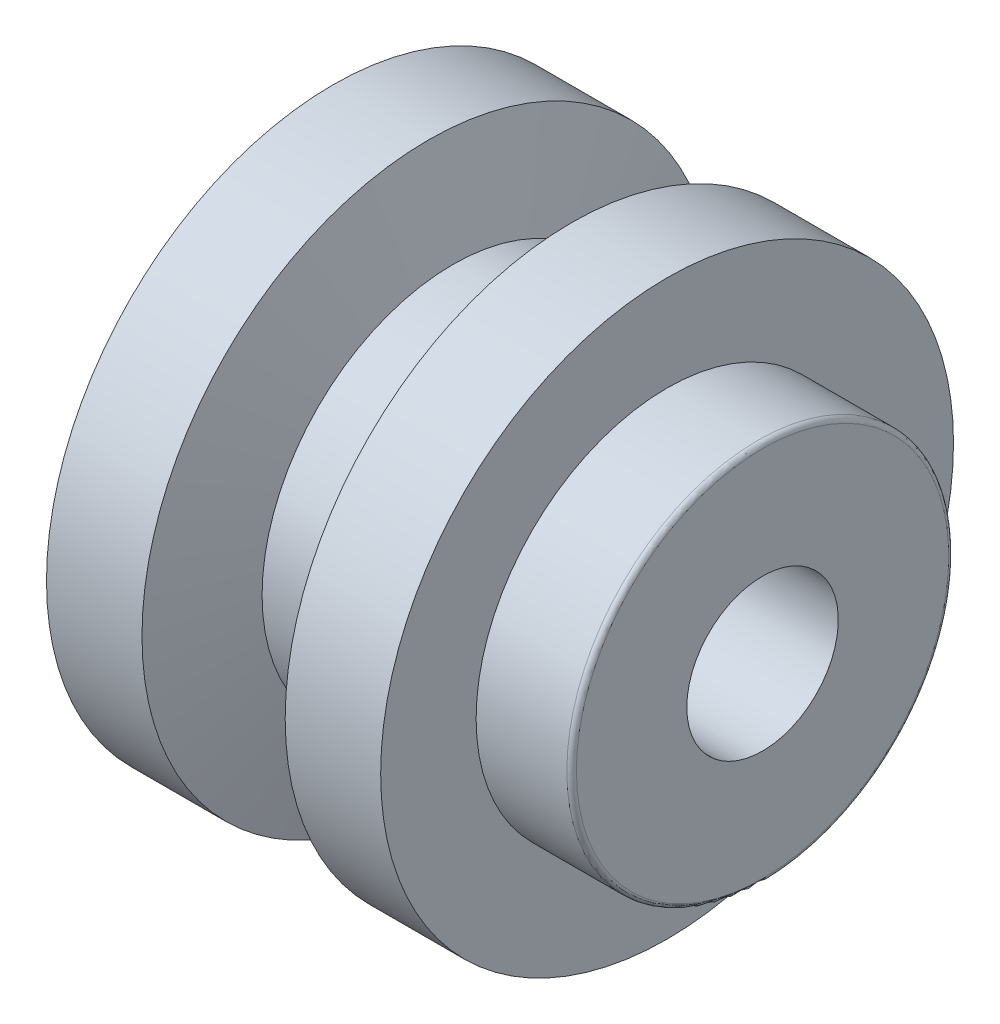
ISO-10303-21;
HEADER;
FILE_DESCRIPTION(('STEP AP214'),'2;1');
FILE_NAME('part.step','',(''),(''),'','','');
FILE_SCHEMA(('AUTOMOTIVE_DESIGN { 1 0 10303 214 1 1 1 1 }'));
ENDSEC;
DATA;
#1=APPLICATION_CONTEXT('core data for automotive mechanical design processes');
#2=APPLICATION_PROTOCOL_DEFINITION('international standard','automotive_design',2000,#1);
#3=PRODUCT_CONTEXT('',#1,'mechanical');
#4=PRODUCT('Part','Part','',(#3));
#5=PRODUCT_RELATED_PRODUCT_CATEGORY('part','',(#4));
#6=PRODUCT_DEFINITION_FORMATION('','',#4);
#7=PRODUCT_DEFINITION_CONTEXT('part definition',#1,'design');
#8=PRODUCT_DEFINITION('design','',#6,#7);
#9=PRODUCT_DEFINITION_SHAPE('','',#8);
#10=(LENGTH_UNIT() NAMED_UNIT(*) SI_UNIT(.MILLI.,.METRE.));
#11=(NAMED_UNIT(*) PLANE_ANGLE_UNIT() SI_UNIT($,.RADIAN.));
#12=(NAMED_UNIT(*) SI_UNIT($,.STERADIAN.) SOLID_ANGLE_UNIT());
#13=UNCERTAINTY_MEASURE_WITH_UNIT(LENGTH_MEASURE(1.E-05),#10,'distance_accuracy_value','');
#14=(GEOMETRIC_REPRESENTATION_CONTEXT(3) GLOBAL_UNCERTAINTY_ASSIGNED_CONTEXT((#13)) GLOBAL_UNIT_ASSIGNED_CONTEXT((#10,
#11,#12)) REPRESENTATION_CONTEXT('',''));
#15=CARTESIAN_POINT('',(0.,0.,0.));
#16=DIRECTION('',(0.,0.,1.));
#17=DIRECTION('',(1.,0.,0.));
#18=AXIS2_PLACEMENT_3D('',#15,#16,#17);
#19=CARTESIAN_POINT('',(2.5,0.,0.));
#20=DIRECTION('',(-1.,0.,0.));
#21=DIRECTION('',(0.,0.,1.));
#22=AXIS2_PLACEMENT_3D('',#19,#20,#21);
#23=CONICAL_SURFACE('',#22,7.935,1.32581766366803);
#24=CARTESIAN_POINT('',(0.,0.,0.));
#25=DIRECTION('',(-1.,0.,0.));
#26=DIRECTION('',(0.,0.,1.));
#27=AXIS2_PLACEMENT_3D('',#24,#25,#26);
#28=CIRCLE('',#27,17.935);
#29=CARTESIAN_POINT('',(0.,0.,17.935));
#30=VERTEX_POINT('',#29);
#31=EDGE_CURVE('E10',#30,#30,#28,.T.);
#32=ORIENTED_EDGE('',*,*,#31,.T.);
#33=EDGE_LOOP('',(#32));
#34=FACE_BOUND('',#33,.T.);
#35=CARTESIAN_POINT('',(2.5,0.,0.));
#36=DIRECTION('',(-1.,0.,0.));
#37=DIRECTION('',(0.,0.,1.));
#38=AXIS2_PLACEMENT_3D('',#35,#36,#37);
#39=CIRCLE('',#38,7.935);
#40=CARTESIAN_POINT('',(2.5,0.,7.935));
#41=VERTEX_POINT('',#40);
#42=EDGE_CURVE('E70',#41,#41,#39,.T.);
#43=ORIENTED_EDGE('',*,*,#42,.F.);
#44=EDGE_LOOP('',(#43));
#45=FACE_BOUND('',#44,.T.);
#46=ADVANCED_FACE('F30',(#34,#45),#23,.F.);
#47=CARTESIAN_POINT('',(0.,-17.935,0.));
#48=DIRECTION('',(-1.,0.,0.));
#49=DIRECTION('',(0.,0.,1.));
#50=AXIS2_PLACEMENT_3D('',#47,#48,#49);
#51=PLANE('',#50);
#52=CARTESIAN_POINT('',(0.,0.,0.));
#53=DIRECTION('',(-1.,0.,0.));
#54=DIRECTION('',(0.,0.,1.));
#55=AXIS2_PLACEMENT_3D('',#52,#53,#54);
#56=CIRCLE('',#55,30.);
#57=CARTESIAN_POINT('',(0.,0.,30.));
#58=VERTEX_POINT('',#57);
#59=EDGE_CURVE('E36',#58,#58,#56,.T.);
#60=ORIENTED_EDGE('',*,*,#59,.T.);
#61=EDGE_LOOP('',(#60));
#62=FACE_BOUND('',#61,.T.);
#63=ORIENTED_EDGE('',*,*,#31,.F.);
#64=EDGE_LOOP('',(#63));
#65=FACE_BOUND('',#64,.T.);
#66=ADVANCED_FACE('F78',(#62,#65),#51,.T.);
#67=CARTESIAN_POINT('',(0.,0.,0.));
#68=DIRECTION('',(-1.,0.,0.));
#69=DIRECTION('',(0.,0.,1.));
#70=AXIS2_PLACEMENT_3D('',#67,#68,#69);
#71=CYLINDRICAL_SURFACE('',#70,30.);
#72=CARTESIAN_POINT('',(10.,0.,0.));
#73=DIRECTION('',(-1.,0.,0.));
#74=DIRECTION('',(0.,0.,1.));
#75=AXIS2_PLACEMENT_3D('',#72,#73,#74);
#76=CIRCLE('',#75,30.);
#77=CARTESIAN_POINT('',(10.,0.,30.));
#78=VERTEX_POINT('',#77);
#79=EDGE_CURVE('E40',#78,#78,#76,.T.);
#80=ORIENTED_EDGE('',*,*,#79,.T.);
#81=EDGE_LOOP('',(#80));
#82=FACE_BOUND('',#81,.T.);
#83=ORIENTED_EDGE('',*,*,#59,.F.);
#84=EDGE_LOOP('',(#83));
#85=FACE_BOUND('',#84,.T.);
#86=ADVANCED_FACE('F82',(#82,#85),#71,.T.);
#87=CARTESIAN_POINT('',(10.,0.,0.));
#88=DIRECTION('',(-1.,0.,0.));
#89=DIRECTION('',(0.,0.,1.));
#90=AXIS2_PLACEMENT_3D('',#87,#88,#89);
#91=CONICAL_SURFACE('',#90,30.,1.31828449075429);
#92=CARTESIAN_POINT('',(12.5801925051561,0.,0.));
#93=DIRECTION('',(-1.,0.,0.));
#94=DIRECTION('',(0.,0.,1.));
#95=AXIS2_PLACEMENT_3D('',#92,#93,#94);
#96=CIRCLE('',#95,20.);
#97=CARTESIAN_POINT('',(12.5801925051561,0.,20.));
#98=VERTEX_POINT('',#97);
#99=EDGE_CURVE('E44',#98,#98,#96,.T.);
#100=ORIENTED_EDGE('',*,*,#99,.T.);
#101=EDGE_LOOP('',(#100));
#102=FACE_BOUND('',#101,.T.);
#103=ORIENTED_EDGE('',*,*,#79,.F.);
#104=EDGE_LOOP('',(#103));
#105=FACE_BOUND('',#104,.T.);
#106=ADVANCED_FACE('F86',(#102,#105),#91,.T.);
#107=CARTESIAN_POINT('',(0.,0.,0.));
#108=DIRECTION('',(-1.,0.,0.));
#109=DIRECTION('',(0.,0.,1.));
#110=AXIS2_PLACEMENT_3D('',#107,#108,#109);
#111=CYLINDRICAL_SURFACE('',#110,20.);
#112=CARTESIAN_POINT('',(22.3205080756888,0.,0.));
#113=DIRECTION('',(-1.,0.,0.));
#114=DIRECTION('',(0.,0.,1.));
#115=AXIS2_PLACEMENT_3D('',#112,#113,#114);
#116=CIRCLE('',#115,20.);
#117=CARTESIAN_POINT('',(22.3205080756888,0.,20.));
#118=VERTEX_POINT('',#117);
#119=EDGE_CURVE('E49',#118,#118,#116,.T.);
#120=ORIENTED_EDGE('',*,*,#119,.T.);
#121=EDGE_LOOP('',(#120));
#122=FACE_BOUND('',#121,.T.);
#123=ORIENTED_EDGE('',*,*,#99,.F.);
#124=EDGE_LOOP('',(#123));
#125=FACE_BOUND('',#124,.T.);
#126=ADVANCED_FACE('F93',(#122,#125),#111,.T.);
#127=CARTESIAN_POINT('',(22.3205080756888,0.,0.));
#128=DIRECTION('',(1.,0.,0.));
#129=DIRECTION('',(0.,0.,-1.));
#130=AXIS2_PLACEMENT_3D('',#127,#128,#129);
#131=CONICAL_SURFACE('',#130,20.,1.30899693899575);
#132=CARTESIAN_POINT('',(25.,0.,0.));
#133=DIRECTION('',(-1.,0.,0.));
#134=DIRECTION('',(0.,0.,1.));
#135=AXIS2_PLACEMENT_3D('',#132,#133,#134);
#136=CIRCLE('',#135,30.);
#137=CARTESIAN_POINT('',(25.,0.,30.));
#138=VERTEX_POINT('',#137);
#139=EDGE_CURVE('E52',#138,#138,#136,.T.);
#140=ORIENTED_EDGE('',*,*,#139,.T.);
#141=EDGE_LOOP('',(#140));
#142=FACE_BOUND('',#141,.T.);
#143=ORIENTED_EDGE('',*,*,#119,.F.);
#144=EDGE_LOOP('',(#143));
#145=FACE_BOUND('',#144,.T.);
#146=ADVANCED_FACE('F97',(#142,#145),#131,.T.);
#147=CARTESIAN_POINT('',(0.,0.,0.));
#148=DIRECTION('',(-1.,0.,0.));
#149=DIRECTION('',(0.,0.,1.));
#150=AXIS2_PLACEMENT_3D('',#147,#148,#149);
#151=CYLINDRICAL_SURFACE('',#150,30.);
#152=CARTESIAN_POINT('',(35.,0.,0.));
#153=DIRECTION('',(-1.,0.,0.));
#154=DIRECTION('',(0.,0.,1.));
#155=AXIS2_PLACEMENT_3D('',#152,#153,#154);
#156=CIRCLE('',#155,30.);
#157=CARTESIAN_POINT('',(35.,0.,30.));
#158=VERTEX_POINT('',#157);
#159=EDGE_CURVE('E55',#158,#158,#156,.T.);
#160=ORIENTED_EDGE('',*,*,#159,.T.);
#161=EDGE_LOOP('',(#160));
#162=FACE_BOUND('',#161,.T.);
#163=ORIENTED_EDGE('',*,*,#139,.F.);
#164=EDGE_LOOP('',(#163));
#165=FACE_BOUND('',#164,.T.);
#166=ADVANCED_FACE('F101',(#162,#165),#151,.T.);
#167=CARTESIAN_POINT('',(35.,-30.,0.));
#168=DIRECTION('',(1.,0.,0.));
#169=DIRECTION('',(0.,0.,-1.));
#170=AXIS2_PLACEMENT_3D('',#167,#168,#169);
#171=PLANE('',#170);
#172=CARTESIAN_POINT('',(35.,0.,0.));
#173=DIRECTION('',(-1.,0.,0.));
#174=DIRECTION('',(0.,0.,1.));
#175=AXIS2_PLACEMENT_3D('',#172,#173,#174);
#176=CIRCLE('',#175,20.);
#177=CARTESIAN_POINT('',(35.,0.,20.));
#178=VERTEX_POINT('',#177);
#179=EDGE_CURVE('E58',#178,#178,#176,.T.);
#180=ORIENTED_EDGE('',*,*,#179,.T.);
#181=EDGE_LOOP('',(#180));
#182=FACE_BOUND('',#181,.T.);
#183=ORIENTED_EDGE('',*,*,#159,.F.);
#184=EDGE_LOOP('',(#183));
#185=FACE_BOUND('',#184,.T.);
#186=ADVANCED_FACE('F105',(#182,#185),#171,.T.);
#187=CARTESIAN_POINT('',(0.,0.,0.));
#188=DIRECTION('',(-1.,0.,0.));
#189=DIRECTION('',(0.,0.,1.));
#190=AXIS2_PLACEMENT_3D('',#187,#188,#189);
#191=CYLINDRICAL_SURFACE('',#190,20.);
#192=CARTESIAN_POINT('',(44.5,0.,0.));
#193=DIRECTION('',(-1.,0.,0.));
#194=DIRECTION('',(0.,0.,1.));
#195=AXIS2_PLACEMENT_3D('',#192,#193,#194);
#196=CIRCLE('',#195,20.);
#197=CARTESIAN_POINT('',(44.5,0.,20.));
#198=VERTEX_POINT('',#197);
#199=EDGE_CURVE('E61',#198,#198,#196,.T.);
#200=ORIENTED_EDGE('',*,*,#199,.T.);
#201=EDGE_LOOP('',(#200));
#202=FACE_BOUND('',#201,.T.);
#203=ORIENTED_EDGE('',*,*,#179,.F.);
#204=EDGE_LOOP('',(#203));
#205=FACE_BOUND('',#204,.T.);
#206=ADVANCED_FACE('F109',(#202,#205),#191,.T.);
#207=CARTESIAN_POINT('',(44.5,0.,0.));
#208=DIRECTION('',(-1.,0.,0.));
#209=DIRECTION('',(0.,0.,1.));
#210=AXIS2_PLACEMENT_3D('',#207,#208,#209);
#211=TOROIDAL_SURFACE('',#210,19.5,0.500000000000002);
#212=CARTESIAN_POINT('',(45.,0.,0.));
#213=DIRECTION('',(-1.,0.,0.));
#214=DIRECTION('',(0.,0.,1.));
#215=AXIS2_PLACEMENT_3D('',#212,#213,#214);
#216=CIRCLE('',#215,19.5);
#217=CARTESIAN_POINT('',(45.,0.,19.5));
#218=VERTEX_POINT('',#217);
#219=EDGE_CURVE('E64',#218,#218,#216,.T.);
#220=ORIENTED_EDGE('',*,*,#219,.T.);
#221=EDGE_LOOP('',(#220));
#222=FACE_BOUND('',#221,.T.);
#223=ORIENTED_EDGE('',*,*,#199,.F.);
#224=EDGE_LOOP('',(#223));
#225=FACE_BOUND('',#224,.T.);
#226=ADVANCED_FACE('F113',(#222,#225),#211,.T.);
#227=CARTESIAN_POINT('',(45.,-19.5,0.));
#228=DIRECTION('',(1.,0.,0.));
#229=DIRECTION('',(0.,0.,-1.));
#230=AXIS2_PLACEMENT_3D('',#227,#228,#229);
#231=PLANE('',#230);
#232=CARTESIAN_POINT('',(45.,0.,0.));
#233=DIRECTION('',(-1.,0.,0.));
#234=DIRECTION('',(0.,0.,1.));
#235=AXIS2_PLACEMENT_3D('',#232,#233,#234);
#236=CIRCLE('',#235,7.935);
#237=CARTESIAN_POINT('',(45.,0.,7.935));
#238=VERTEX_POINT('',#237);
#239=EDGE_CURVE('E67',#238,#238,#236,.T.);
#240=ORIENTED_EDGE('',*,*,#239,.T.);
#241=EDGE_LOOP('',(#240));
#242=FACE_BOUND('',#241,.T.);
#243=ORIENTED_EDGE('',*,*,#219,.F.);
#244=EDGE_LOOP('',(#243));
#245=FACE_BOUND('',#244,.T.);
#246=ADVANCED_FACE('F117',(#242,#245),#231,.T.);
#247=CARTESIAN_POINT('',(0.,0.,0.));
#248=DIRECTION('',(-1.,0.,0.));
#249=DIRECTION('',(0.,0.,1.));
#250=AXIS2_PLACEMENT_3D('',#247,#248,#249);
#251=CYLINDRICAL_SURFACE('',#250,7.935);
#252=ORIENTED_EDGE('',*,*,#42,.T.);
#253=EDGE_LOOP('',(#252));
#254=FACE_BOUND('',#253,.T.);
#255=ORIENTED_EDGE('',*,*,#239,.F.);
#256=EDGE_LOOP('',(#255));
#257=FACE_BOUND('',#256,.T.);
#258=ADVANCED_FACE('F74',(#254,#257),#251,.F.);
#259=CLOSED_SHELL('',(#46,#66,#86,#106,#126,#146,#166,#186,#206,#226,#246,#258));
#260=MANIFOLD_SOLID_BREP('B2',#259);
#261=ADVANCED_BREP_SHAPE_REPRESENTATION('',(#18,#260),#14);
#262=SHAPE_DEFINITION_REPRESENTATION(#9,#261);
ENDSEC;
END-ISO-10303-21;
